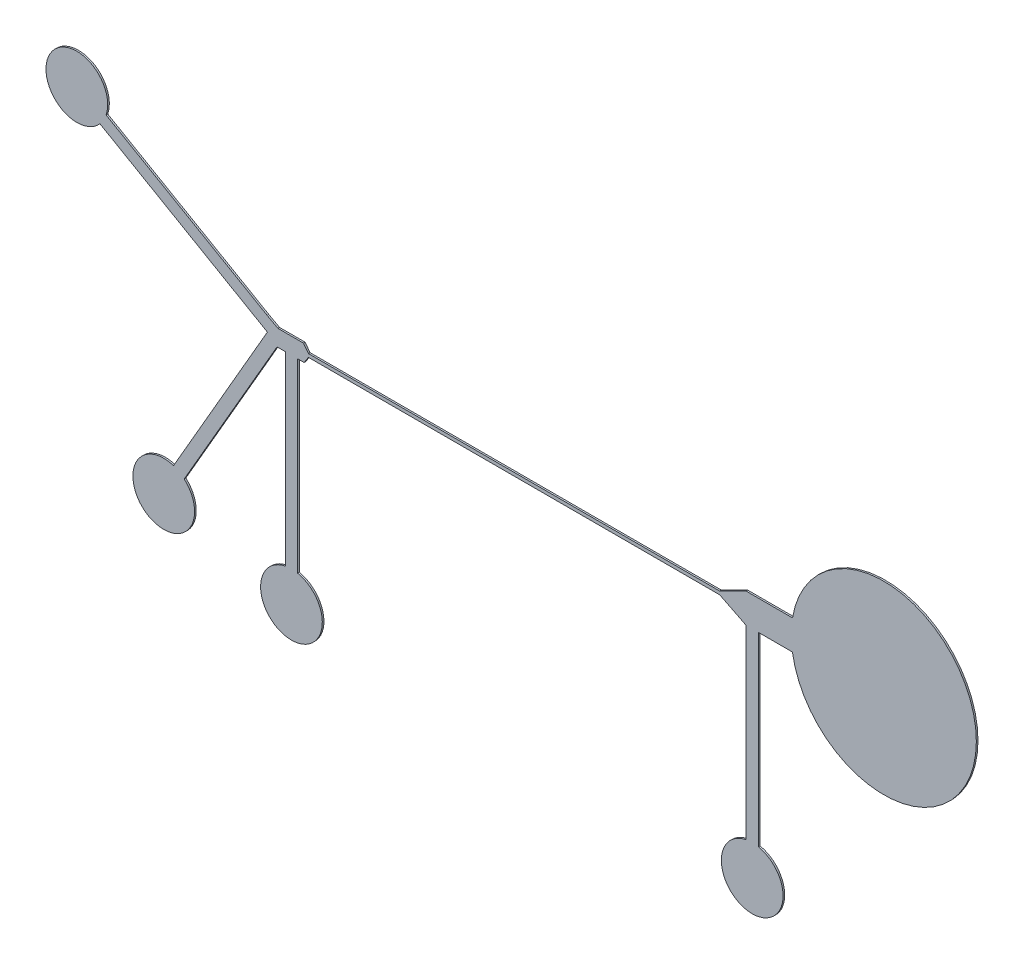
ISO-10303-21;
HEADER;
FILE_DESCRIPTION(('STEP AP214'),'2;1');
FILE_NAME('part.step','',(''),(''),'','','');
FILE_SCHEMA(('AUTOMOTIVE_DESIGN { 1 0 10303 214 1 1 1 1 }'));
ENDSEC;
DATA;
#1=APPLICATION_CONTEXT('core data for automotive mechanical design processes');
#2=APPLICATION_PROTOCOL_DEFINITION('international standard','automotive_design',2000,#1);
#3=PRODUCT_CONTEXT('',#1,'mechanical');
#4=PRODUCT('Part','Part','',(#3));
#5=PRODUCT_RELATED_PRODUCT_CATEGORY('part','',(#4));
#6=PRODUCT_DEFINITION_FORMATION('','',#4);
#7=PRODUCT_DEFINITION_CONTEXT('part definition',#1,'design');
#8=PRODUCT_DEFINITION('design','',#6,#7);
#9=PRODUCT_DEFINITION_SHAPE('','',#8);
#10=(LENGTH_UNIT() NAMED_UNIT(*) SI_UNIT(.MILLI.,.METRE.));
#11=(NAMED_UNIT(*) PLANE_ANGLE_UNIT() SI_UNIT($,.RADIAN.));
#12=(NAMED_UNIT(*) SI_UNIT($,.STERADIAN.) SOLID_ANGLE_UNIT());
#13=UNCERTAINTY_MEASURE_WITH_UNIT(LENGTH_MEASURE(1.E-05),#10,'distance_accuracy_value','');
#14=(GEOMETRIC_REPRESENTATION_CONTEXT(3) GLOBAL_UNCERTAINTY_ASSIGNED_CONTEXT((#13)) GLOBAL_UNIT_ASSIGNED_CONTEXT((#10,
#11,#12)) REPRESENTATION_CONTEXT('',''));
#15=CARTESIAN_POINT('',(0.,0.,0.));
#16=DIRECTION('',(0.,0.,1.));
#17=DIRECTION('',(1.,0.,0.));
#18=AXIS2_PLACEMENT_3D('',#15,#16,#17);
#19=CARTESIAN_POINT('',(-1.71303554255497,-0.242617959881908,0.04));
#20=DIRECTION('',(0.,1.,0.));
#21=DIRECTION('',(0.,0.,1.));
#22=AXIS2_PLACEMENT_3D('',#19,#20,#21);
#23=PLANE('',#22);
#24=DIRECTION('',(1.,0.,0.));
#25=VECTOR('',#24,1.);
#26=CARTESIAN_POINT('',(-1.71303554255497,-0.242617959881908,0.));
#27=LINE('',#26,#25);
#28=CARTESIAN_POINT('',(-1.71303554255497,-0.242617959881908,0.));
#29=VERTEX_POINT('',#28);
#30=CARTESIAN_POINT('',(-1.55303554255497,-0.242617959881908,0.));
#31=VERTEX_POINT('',#30);
#32=EDGE_CURVE('E262',#29,#31,#27,.T.);
#33=ORIENTED_EDGE('',*,*,#32,.T.);
#34=DIRECTION('',(0.,0.,-1.));
#35=VECTOR('',#34,1.);
#36=CARTESIAN_POINT('',(-1.55303554255497,-0.242617959881908,0.04));
#37=LINE('',#36,#35);
#38=CARTESIAN_POINT('',(-1.55303554255497,-0.242617959881908,0.04));
#39=VERTEX_POINT('',#38);
#40=EDGE_CURVE('E52',#39,#31,#37,.T.);
#41=ORIENTED_EDGE('',*,*,#40,.F.);
#42=DIRECTION('',(1.,0.,0.));
#43=VECTOR('',#42,1.);
#44=CARTESIAN_POINT('',(-1.71303554255497,-0.242617959881908,0.04));
#45=LINE('',#44,#43);
#46=CARTESIAN_POINT('',(-1.71303554255497,-0.242617959881908,0.04));
#47=VERTEX_POINT('',#46);
#48=EDGE_CURVE('E160',#47,#39,#45,.T.);
#49=ORIENTED_EDGE('',*,*,#48,.F.);
#50=DIRECTION('',(0.,0.,-1.));
#51=VECTOR('',#50,1.);
#52=CARTESIAN_POINT('',(-1.71303554255497,-0.242617959881908,0.04));
#53=LINE('',#52,#51);
#54=EDGE_CURVE('E11',#47,#29,#53,.T.);
#55=ORIENTED_EDGE('',*,*,#54,.T.);
#56=EDGE_LOOP('',(#33,#41,#49,#55));
#57=FACE_BOUND('',#56,.T.);
#58=ADVANCED_FACE('F43',(#57),#23,.F.);
#59=CARTESIAN_POINT('',(-1.45050282300813,-0.082617959881908,0.04));
#60=DIRECTION('',(-0.841954161364946,0.539549061865787,0.));
#61=DIRECTION('',(-0.539549061865787,-0.841954161364946,0.));
#62=AXIS2_PLACEMENT_3D('',#59,#60,#61);
#63=PLANE('',#62);
#64=DIRECTION('',(0.539549061865787,0.841954161364946,0.));
#65=VECTOR('',#64,1.);
#66=CARTESIAN_POINT('',(-1.45050282300813,-0.082617959881908,0.));
#67=LINE('',#66,#65);
#68=CARTESIAN_POINT('',(-1.45050282300813,-0.082617959881908,0.));
#69=VERTEX_POINT('',#68);
#70=EDGE_CURVE('E265',#31,#69,#67,.T.);
#71=ORIENTED_EDGE('',*,*,#70,.T.);
#72=DIRECTION('',(0.,0.,-1.));
#73=VECTOR('',#72,1.);
#74=CARTESIAN_POINT('',(-1.45050282300813,-0.082617959881908,0.04));
#75=LINE('',#74,#73);
#76=CARTESIAN_POINT('',(-1.45050282300813,-0.082617959881908,0.04));
#77=VERTEX_POINT('',#76);
#78=EDGE_CURVE('E429',#77,#69,#75,.T.);
#79=ORIENTED_EDGE('',*,*,#78,.F.);
#80=DIRECTION('',(0.539549061865787,0.841954161364946,0.));
#81=VECTOR('',#80,1.);
#82=CARTESIAN_POINT('',(-1.45050282300813,-0.082617959881908,0.04));
#83=LINE('',#82,#81);
#84=EDGE_CURVE('E439',#39,#77,#83,.T.);
#85=ORIENTED_EDGE('',*,*,#84,.F.);
#86=ORIENTED_EDGE('',*,*,#40,.T.);
#87=EDGE_LOOP('',(#71,#79,#85,#86));
#88=FACE_BOUND('',#87,.T.);
#89=ADVANCED_FACE('F437',(#88),#63,.F.);
#90=CARTESIAN_POINT('',(-1.45050282300813,-0.082617959881908,0.04));
#91=DIRECTION('',(0.,1.,0.));
#92=DIRECTION('',(0.,0.,1.));
#93=AXIS2_PLACEMENT_3D('',#90,#91,#92);
#94=PLANE('',#93);
#95=DIRECTION('',(1.,0.,0.));
#96=VECTOR('',#95,1.);
#97=CARTESIAN_POINT('',(-1.45050282300813,-0.082617959881908,0.));
#98=LINE('',#97,#96);
#99=CARTESIAN_POINT('',(8.54949717699187,-0.082617959881908,0.));
#100=VERTEX_POINT('',#99);
#101=EDGE_CURVE('E268',#69,#100,#98,.T.);
#102=ORIENTED_EDGE('',*,*,#101,.T.);
#103=DIRECTION('',(0.,0.,-1.));
#104=VECTOR('',#103,1.);
#105=CARTESIAN_POINT('',(8.54949717699187,-0.082617959881908,0.04));
#106=LINE('',#105,#104);
#107=CARTESIAN_POINT('',(8.54949717699187,-0.082617959881908,0.04));
#108=VERTEX_POINT('',#107);
#109=EDGE_CURVE('E425',#108,#100,#106,.T.);
#110=ORIENTED_EDGE('',*,*,#109,.F.);
#111=DIRECTION('',(1.,0.,0.));
#112=VECTOR('',#111,1.);
#113=CARTESIAN_POINT('',(-1.45050282300813,-0.082617959881908,0.04));
#114=LINE('',#113,#112);
#115=EDGE_CURVE('E458',#77,#108,#114,.T.);
#116=ORIENTED_EDGE('',*,*,#115,.F.);
#117=ORIENTED_EDGE('',*,*,#78,.T.);
#118=EDGE_LOOP('',(#102,#110,#116,#117));
#119=FACE_BOUND('',#118,.T.);
#120=ADVANCED_FACE('F448',(#119),#94,.F.);
#121=CARTESIAN_POINT('',(8.54949717699187,-0.082617959881908,0.04));
#122=DIRECTION('',(0.447213595499958,0.894427190999916,0.));
#123=DIRECTION('',(-0.894427190999916,0.447213595499958,0.));
#124=AXIS2_PLACEMENT_3D('',#121,#122,#123);
#125=PLANE('',#124);
#126=DIRECTION('',(0.894427190999916,-0.447213595499958,0.));
#127=VECTOR('',#126,1.);
#128=CARTESIAN_POINT('',(8.54949717699187,-0.082617959881908,0.));
#129=LINE('',#128,#127);
#130=CARTESIAN_POINT('',(9.18949717699187,-0.402617959881908,0.));
#131=VERTEX_POINT('',#130);
#132=EDGE_CURVE('E271',#100,#131,#129,.T.);
#133=ORIENTED_EDGE('',*,*,#132,.T.);
#134=DIRECTION('',(0.,0.,-1.));
#135=VECTOR('',#134,1.);
#136=CARTESIAN_POINT('',(9.18949717699187,-0.402617959881908,0.04));
#137=LINE('',#136,#135);
#138=CARTESIAN_POINT('',(9.18949717699187,-0.402617959881908,0.04));
#139=VERTEX_POINT('',#138);
#140=EDGE_CURVE('E421',#139,#131,#137,.T.);
#141=ORIENTED_EDGE('',*,*,#140,.F.);
#142=DIRECTION('',(0.894427190999916,-0.447213595499958,0.));
#143=VECTOR('',#142,1.);
#144=CARTESIAN_POINT('',(8.54949717699187,-0.082617959881908,0.04));
#145=LINE('',#144,#143);
#146=EDGE_CURVE('E454',#108,#139,#145,.T.);
#147=ORIENTED_EDGE('',*,*,#146,.F.);
#148=ORIENTED_EDGE('',*,*,#109,.T.);
#149=EDGE_LOOP('',(#133,#141,#147,#148));
#150=FACE_BOUND('',#149,.T.);
#151=ADVANCED_FACE('F452',(#150),#125,.F.);
#152=CARTESIAN_POINT('',(9.18949717699187,-4.90261795988191,0.04));
#153=DIRECTION('',(1.,0.,0.));
#154=DIRECTION('',(0.,0.,-1.));
#155=AXIS2_PLACEMENT_3D('',#152,#153,#154);
#156=PLANE('',#155);
#157=DIRECTION('',(0.,-1.,0.));
#158=VECTOR('',#157,1.);
#159=CARTESIAN_POINT('',(9.18949717699187,-4.90261795988191,0.));
#160=LINE('',#159,#158);
#161=CARTESIAN_POINT('',(9.18949717699187,-4.91777103704695,0.));
#162=VERTEX_POINT('',#161);
#163=EDGE_CURVE('E275',#131,#162,#160,.T.);
#164=ORIENTED_EDGE('',*,*,#163,.T.);
#165=DIRECTION('',(0.,0.,-1.));
#166=VECTOR('',#165,1.);
#167=CARTESIAN_POINT('',(9.18949717699187,-4.91777103704695,0.04));
#168=LINE('',#167,#166);
#169=CARTESIAN_POINT('',(9.18949717699187,-4.91777103704695,0.04));
#170=VERTEX_POINT('',#169);
#171=EDGE_CURVE('E417',#170,#162,#168,.T.);
#172=ORIENTED_EDGE('',*,*,#171,.F.);
#173=DIRECTION('',(0.,-1.,0.));
#174=VECTOR('',#173,1.);
#175=CARTESIAN_POINT('',(9.18949717699187,-0.402617959881908,0.04));
#176=LINE('',#175,#174);
#177=EDGE_CURVE('E457',#139,#170,#176,.T.);
#178=ORIENTED_EDGE('',*,*,#177,.F.);
#179=ORIENTED_EDGE('',*,*,#140,.T.);
#180=EDGE_LOOP('',(#164,#172,#178,#179));
#181=FACE_BOUND('',#180,.T.);
#182=ADVANCED_FACE('F550',(#181),#156,.F.);
#183=CARTESIAN_POINT('',(9.33949717699187,-5.65261795988191,0.04));
#184=DIRECTION('',(0.,0.,-1.));
#185=DIRECTION('',(-1.,0.,0.));
#186=AXIS2_PLACEMENT_3D('',#183,#184,#185);
#187=CYLINDRICAL_SURFACE('',#186,0.75);
#188=CARTESIAN_POINT('',(9.33949717699187,-5.65261795988191,0.));
#189=DIRECTION('',(0.,0.,1.));
#190=DIRECTION('',(1.,0.,0.));
#191=AXIS2_PLACEMENT_3D('',#188,#189,#190);
#192=CIRCLE('',#191,0.75);
#193=CARTESIAN_POINT('',(9.48949717699187,-4.91777103704695,0.));
#194=VERTEX_POINT('',#193);
#195=EDGE_CURVE('E278',#162,#194,#192,.T.);
#196=ORIENTED_EDGE('',*,*,#195,.T.);
#197=DIRECTION('',(0.,0.,-1.));
#198=VECTOR('',#197,1.);
#199=CARTESIAN_POINT('',(9.48949717699187,-4.91777103704695,0.04));
#200=LINE('',#199,#198);
#201=CARTESIAN_POINT('',(9.48949717699187,-4.91777103704695,0.04));
#202=VERTEX_POINT('',#201);
#203=EDGE_CURVE('E413',#202,#194,#200,.T.);
#204=ORIENTED_EDGE('',*,*,#203,.F.);
#205=CARTESIAN_POINT('',(9.33949717699187,-5.65261795988191,0.04));
#206=DIRECTION('',(0.,0.,1.));
#207=DIRECTION('',(1.,0.,0.));
#208=AXIS2_PLACEMENT_3D('',#205,#206,#207);
#209=CIRCLE('',#208,0.75);
#210=EDGE_CURVE('E462',#170,#202,#209,.T.);
#211=ORIENTED_EDGE('',*,*,#210,.F.);
#212=ORIENTED_EDGE('',*,*,#171,.T.);
#213=EDGE_LOOP('',(#196,#204,#211,#212));
#214=FACE_BOUND('',#213,.T.);
#215=ADVANCED_FACE('F553',(#214),#187,.T.);
#216=CARTESIAN_POINT('',(9.48949717699187,-0.402617959881908,0.04));
#217=DIRECTION('',(-1.,0.,0.));
#218=DIRECTION('',(0.,0.,1.));
#219=AXIS2_PLACEMENT_3D('',#216,#217,#218);
#220=PLANE('',#219);
#221=DIRECTION('',(0.,1.,0.));
#222=VECTOR('',#221,1.);
#223=CARTESIAN_POINT('',(9.48949717699187,-0.402617959881908,0.));
#224=LINE('',#223,#222);
#225=CARTESIAN_POINT('',(9.48949717699187,-0.402617959881908,0.));
#226=VERTEX_POINT('',#225);
#227=EDGE_CURVE('E282',#194,#226,#224,.T.);
#228=ORIENTED_EDGE('',*,*,#227,.T.);
#229=DIRECTION('',(0.,0.,-1.));
#230=VECTOR('',#229,1.);
#231=CARTESIAN_POINT('',(9.48949717699187,-0.402617959881908,0.04));
#232=LINE('',#231,#230);
#233=CARTESIAN_POINT('',(9.48949717699187,-0.402617959881908,0.04));
#234=VERTEX_POINT('',#233);
#235=EDGE_CURVE('E409',#234,#226,#232,.T.);
#236=ORIENTED_EDGE('',*,*,#235,.F.);
#237=DIRECTION('',(0.,1.,0.));
#238=VECTOR('',#237,1.);
#239=CARTESIAN_POINT('',(9.48949717699187,-4.90261795988191,0.04));
#240=LINE('',#239,#238);
#241=EDGE_CURVE('E469',#202,#234,#240,.T.);
#242=ORIENTED_EDGE('',*,*,#241,.F.);
#243=ORIENTED_EDGE('',*,*,#203,.T.);
#244=EDGE_LOOP('',(#228,#236,#242,#243));
#245=FACE_BOUND('',#244,.T.);
#246=ADVANCED_FACE('F557',(#245),#220,.F.);
#247=CARTESIAN_POINT('',(10.2894971769919,-0.402617959881908,0.04));
#248=DIRECTION('',(0.,1.,0.));
#249=DIRECTION('',(0.,0.,1.));
#250=AXIS2_PLACEMENT_3D('',#247,#248,#249);
#251=PLANE('',#250);
#252=DIRECTION('',(1.,0.,0.));
#253=VECTOR('',#252,1.);
#254=CARTESIAN_POINT('',(10.2894971769919,-0.402617959881908,0.));
#255=LINE('',#254,#253);
#256=CARTESIAN_POINT('',(10.3174084720832,-0.402617959881908,0.));
#257=VERTEX_POINT('',#256);
#258=EDGE_CURVE('E286',#226,#257,#255,.T.);
#259=ORIENTED_EDGE('',*,*,#258,.T.);
#260=DIRECTION('',(0.,0.,-1.));
#261=VECTOR('',#260,1.);
#262=CARTESIAN_POINT('',(10.3174084720832,-0.402617959881908,0.04));
#263=LINE('',#262,#261);
#264=CARTESIAN_POINT('',(10.3174084720832,-0.402617959881908,0.04));
#265=VERTEX_POINT('',#264);
#266=EDGE_CURVE('E405',#265,#257,#263,.T.);
#267=ORIENTED_EDGE('',*,*,#266,.F.);
#268=DIRECTION('',(1.,0.,0.));
#269=VECTOR('',#268,1.);
#270=CARTESIAN_POINT('',(9.48949717699187,-0.402617959881908,0.04));
#271=LINE('',#270,#269);
#272=EDGE_CURVE('E472',#234,#265,#271,.T.);
#273=ORIENTED_EDGE('',*,*,#272,.F.);
#274=ORIENTED_EDGE('',*,*,#235,.T.);
#275=EDGE_LOOP('',(#259,#267,#273,#274));
#276=FACE_BOUND('',#275,.T.);
#277=ADVANCED_FACE('F561',(#276),#251,.F.);
#278=CARTESIAN_POINT('',(12.5394971769919,-0.0493166896926377,0.04));
#279=DIRECTION('',(0.,0.,-1.));
#280=DIRECTION('',(-1.,0.,0.));
#281=AXIS2_PLACEMENT_3D('',#278,#279,#280);
#282=CYLINDRICAL_SURFACE('',#281,2.25);
#283=CARTESIAN_POINT('',(12.5394971769919,-0.0493166896926377,0.));
#284=DIRECTION('',(0.,0.,1.));
#285=DIRECTION('',(1.,0.,0.));
#286=AXIS2_PLACEMENT_3D('',#283,#284,#285);
#287=CIRCLE('',#286,2.25);
#288=CARTESIAN_POINT('',(10.3195800520624,0.317382040118091,0.));
#289=VERTEX_POINT('',#288);
#290=EDGE_CURVE('E289',#257,#289,#287,.T.);
#291=ORIENTED_EDGE('',*,*,#290,.T.);
#292=DIRECTION('',(0.,0.,-1.));
#293=VECTOR('',#292,1.);
#294=CARTESIAN_POINT('',(10.3195800520624,0.317382040118091,0.04));
#295=LINE('',#294,#293);
#296=CARTESIAN_POINT('',(10.3195800520624,0.317382040118091,0.04));
#297=VERTEX_POINT('',#296);
#298=EDGE_CURVE('E401',#297,#289,#295,.T.);
#299=ORIENTED_EDGE('',*,*,#298,.F.);
#300=CARTESIAN_POINT('',(12.5394971769919,-0.0493166896926377,0.04));
#301=DIRECTION('',(0.,0.,1.));
#302=DIRECTION('',(1.,0.,0.));
#303=AXIS2_PLACEMENT_3D('',#300,#301,#302);
#304=CIRCLE('',#303,2.25);
#305=EDGE_CURVE('E475',#265,#297,#304,.T.);
#306=ORIENTED_EDGE('',*,*,#305,.F.);
#307=ORIENTED_EDGE('',*,*,#266,.T.);
#308=EDGE_LOOP('',(#291,#299,#306,#307));
#309=FACE_BOUND('',#308,.T.);
#310=ADVANCED_FACE('F565',(#309),#282,.T.);
#311=CARTESIAN_POINT('',(9.18949717699187,0.317382040118092,0.04));
#312=DIRECTION('',(0.,-1.,0.));
#313=DIRECTION('',(0.,0.,-1.));
#314=AXIS2_PLACEMENT_3D('',#311,#312,#313);
#315=PLANE('',#314);
#316=DIRECTION('',(-1.,0.,0.));
#317=VECTOR('',#316,1.);
#318=CARTESIAN_POINT('',(9.18949717699187,0.317382040118092,0.));
#319=LINE('',#318,#317);
#320=CARTESIAN_POINT('',(9.18949717699187,0.317382040118092,0.));
#321=VERTEX_POINT('',#320);
#322=EDGE_CURVE('E293',#289,#321,#319,.T.);
#323=ORIENTED_EDGE('',*,*,#322,.T.);
#324=DIRECTION('',(0.,0.,-1.));
#325=VECTOR('',#324,1.);
#326=CARTESIAN_POINT('',(9.18949717699187,0.317382040118092,0.04));
#327=LINE('',#326,#325);
#328=CARTESIAN_POINT('',(9.18949717699187,0.317382040118092,0.04));
#329=VERTEX_POINT('',#328);
#330=EDGE_CURVE('E397',#329,#321,#327,.T.);
#331=ORIENTED_EDGE('',*,*,#330,.F.);
#332=DIRECTION('',(-1.,0.,0.));
#333=VECTOR('',#332,1.);
#334=CARTESIAN_POINT('',(10.2894971769919,0.317382040118092,0.04));
#335=LINE('',#334,#333);
#336=EDGE_CURVE('E478',#297,#329,#335,.T.);
#337=ORIENTED_EDGE('',*,*,#336,.F.);
#338=ORIENTED_EDGE('',*,*,#298,.T.);
#339=EDGE_LOOP('',(#323,#331,#337,#338));
#340=FACE_BOUND('',#339,.T.);
#341=ADVANCED_FACE('F569',(#340),#315,.F.);
#342=CARTESIAN_POINT('',(8.54949717699187,-0.0026179598819079,0.04));
#343=DIRECTION('',(0.447213595499958,-0.894427190999916,0.));
#344=DIRECTION('',(0.894427190999916,0.447213595499958,0.));
#345=AXIS2_PLACEMENT_3D('',#342,#343,#344);
#346=PLANE('',#345);
#347=DIRECTION('',(-0.894427190999916,-0.447213595499958,0.));
#348=VECTOR('',#347,1.);
#349=CARTESIAN_POINT('',(8.54949717699187,-0.0026179598819079,0.));
#350=LINE('',#349,#348);
#351=CARTESIAN_POINT('',(8.54949717699187,-0.0026179598819079,0.));
#352=VERTEX_POINT('',#351);
#353=EDGE_CURVE('E296',#321,#352,#350,.T.);
#354=ORIENTED_EDGE('',*,*,#353,.T.);
#355=DIRECTION('',(0.,0.,-1.));
#356=VECTOR('',#355,1.);
#357=CARTESIAN_POINT('',(8.54949717699187,-0.0026179598819079,0.04));
#358=LINE('',#357,#356);
#359=CARTESIAN_POINT('',(8.54949717699187,-0.0026179598819079,0.04));
#360=VERTEX_POINT('',#359);
#361=EDGE_CURVE('E393',#360,#352,#358,.T.);
#362=ORIENTED_EDGE('',*,*,#361,.F.);
#363=DIRECTION('',(-0.894427190999916,-0.447213595499958,0.));
#364=VECTOR('',#363,1.);
#365=CARTESIAN_POINT('',(8.54949717699187,-0.0026179598819079,0.04));
#366=LINE('',#365,#364);
#367=EDGE_CURVE('E481',#329,#360,#366,.T.);
#368=ORIENTED_EDGE('',*,*,#367,.F.);
#369=ORIENTED_EDGE('',*,*,#330,.T.);
#370=EDGE_LOOP('',(#354,#362,#368,#369));
#371=FACE_BOUND('',#370,.T.);
#372=ADVANCED_FACE('F573',(#371),#346,.F.);
#373=CARTESIAN_POINT('',(-1.45050282300813,-0.0026179598819079,0.04));
#374=DIRECTION('',(0.,-1.,0.));
#375=DIRECTION('',(0.,0.,-1.));
#376=AXIS2_PLACEMENT_3D('',#373,#374,#375);
#377=PLANE('',#376);
#378=DIRECTION('',(-1.,0.,0.));
#379=VECTOR('',#378,1.);
#380=CARTESIAN_POINT('',(-1.45050282300813,-0.0026179598819079,0.));
#381=LINE('',#380,#379);
#382=CARTESIAN_POINT('',(-1.45050282300813,-0.0026179598819079,0.));
#383=VERTEX_POINT('',#382);
#384=EDGE_CURVE('E299',#352,#383,#381,.T.);
#385=ORIENTED_EDGE('',*,*,#384,.T.);
#386=DIRECTION('',(0.,0.,-1.));
#387=VECTOR('',#386,1.);
#388=CARTESIAN_POINT('',(-1.45050282300813,-0.0026179598819079,0.04));
#389=LINE('',#388,#387);
#390=CARTESIAN_POINT('',(-1.45050282300813,-0.0026179598819079,0.04));
#391=VERTEX_POINT('',#390);
#392=EDGE_CURVE('E389',#391,#383,#389,.T.);
#393=ORIENTED_EDGE('',*,*,#392,.F.);
#394=DIRECTION('',(-1.,0.,0.));
#395=VECTOR('',#394,1.);
#396=CARTESIAN_POINT('',(-1.45050282300813,-0.0026179598819079,0.04));
#397=LINE('',#396,#395);
#398=EDGE_CURVE('E484',#360,#391,#397,.T.);
#399=ORIENTED_EDGE('',*,*,#398,.F.);
#400=ORIENTED_EDGE('',*,*,#361,.T.);
#401=EDGE_LOOP('',(#385,#393,#399,#400));
#402=FACE_BOUND('',#401,.T.);
#403=ADVANCED_FACE('F577',(#402),#377,.F.);
#404=CARTESIAN_POINT('',(-1.57050282300813,0.157382040118092,0.04));
#405=DIRECTION('',(-0.8,-0.6,0.));
#406=DIRECTION('',(0.6,-0.8,0.));
#407=AXIS2_PLACEMENT_3D('',#404,#405,#406);
#408=PLANE('',#407);
#409=DIRECTION('',(-0.6,0.8,0.));
#410=VECTOR('',#409,1.);
#411=CARTESIAN_POINT('',(-1.57050282300813,0.157382040118092,0.));
#412=LINE('',#411,#410);
#413=CARTESIAN_POINT('',(-1.57050282300813,0.157382040118092,0.));
#414=VERTEX_POINT('',#413);
#415=EDGE_CURVE('E302',#383,#414,#412,.T.);
#416=ORIENTED_EDGE('',*,*,#415,.T.);
#417=DIRECTION('',(0.,0.,-1.));
#418=VECTOR('',#417,1.);
#419=CARTESIAN_POINT('',(-1.57050282300813,0.157382040118092,0.04));
#420=LINE('',#419,#418);
#421=CARTESIAN_POINT('',(-1.57050282300813,0.157382040118092,0.04));
#422=VERTEX_POINT('',#421);
#423=EDGE_CURVE('E385',#422,#414,#420,.T.);
#424=ORIENTED_EDGE('',*,*,#423,.F.);
#425=DIRECTION('',(-0.6,0.8,0.));
#426=VECTOR('',#425,1.);
#427=CARTESIAN_POINT('',(-1.57050282300813,0.157382040118092,0.04));
#428=LINE('',#427,#426);
#429=EDGE_CURVE('E487',#391,#422,#428,.T.);
#430=ORIENTED_EDGE('',*,*,#429,.F.);
#431=ORIENTED_EDGE('',*,*,#392,.T.);
#432=EDGE_LOOP('',(#416,#424,#430,#431));
#433=FACE_BOUND('',#432,.T.);
#434=ADVANCED_FACE('F581',(#433),#408,.F.);
#435=CARTESIAN_POINT('',(-1.8505027448797,0.157382040118092,0.04));
#436=DIRECTION('',(0.,-1.,0.));
#437=DIRECTION('',(1.,0.,0.));
#438=AXIS2_PLACEMENT_3D('',#435,#436,#437);
#439=PLANE('',#438);
#440=DIRECTION('',(-1.,0.,0.));
#441=VECTOR('',#440,1.);
#442=CARTESIAN_POINT('',(-1.8505027448797,0.157382040118092,0.));
#443=LINE('',#442,#441);
#444=CARTESIAN_POINT('',(-2.19126991202879,0.157382040118092,0.));
#445=VERTEX_POINT('',#444);
#446=EDGE_CURVE('E306',#414,#445,#443,.T.);
#447=ORIENTED_EDGE('',*,*,#446,.T.);
#448=DIRECTION('',(0.,0.,-1.));
#449=VECTOR('',#448,1.);
#450=CARTESIAN_POINT('',(-2.19126991202879,0.157382040118092,0.04));
#451=LINE('',#450,#449);
#452=CARTESIAN_POINT('',(-2.19126991202879,0.157382040118092,0.04));
#453=VERTEX_POINT('',#452);
#454=EDGE_CURVE('E381',#453,#445,#451,.T.);
#455=ORIENTED_EDGE('',*,*,#454,.F.);
#456=DIRECTION('',(-1.,0.,0.));
#457=VECTOR('',#456,1.);
#458=CARTESIAN_POINT('',(-1.8505027448797,0.157382040118092,0.04));
#459=LINE('',#458,#457);
#460=EDGE_CURVE('E490',#422,#453,#459,.T.);
#461=ORIENTED_EDGE('',*,*,#460,.F.);
#462=ORIENTED_EDGE('',*,*,#423,.T.);
#463=EDGE_LOOP('',(#447,#455,#461,#462));
#464=FACE_BOUND('',#463,.T.);
#465=ADVANCED_FACE('F585',(#464),#439,.F.);
#466=CARTESIAN_POINT('',(-2.45944570406879,0.303792201631892,0.04));
#467=DIRECTION('',(-0.479186208676208,-0.877713266058182,0.));
#468=DIRECTION('',(0.877713266058183,-0.479186208676208,0.));
#469=AXIS2_PLACEMENT_3D('',#466,#467,#468);
#470=PLANE('',#469);
#471=DIRECTION('',(-0.877713266058182,0.479186208676208,0.));
#472=VECTOR('',#471,1.);
#473=CARTESIAN_POINT('',(-2.45944570406879,0.303792201631892,0.));
#474=LINE('',#473,#472);
#475=CARTESIAN_POINT('',(-2.45944570406879,0.303792201631892,0.));
#476=VERTEX_POINT('',#475);
#477=EDGE_CURVE('E309',#445,#476,#474,.T.);
#478=ORIENTED_EDGE('',*,*,#477,.T.);
#479=DIRECTION('',(0.,0.,-1.));
#480=VECTOR('',#479,1.);
#481=CARTESIAN_POINT('',(-2.45944570406879,0.303792201631892,0.04));
#482=LINE('',#481,#480);
#483=CARTESIAN_POINT('',(-2.45944570406879,0.303792201631892,0.04));
#484=VERTEX_POINT('',#483);
#485=EDGE_CURVE('E377',#484,#476,#482,.T.);
#486=ORIENTED_EDGE('',*,*,#485,.F.);
#487=DIRECTION('',(-0.877713266058182,0.479186208676208,0.));
#488=VECTOR('',#487,1.);
#489=CARTESIAN_POINT('',(-2.45944570406879,0.303792201631892,0.04));
#490=LINE('',#489,#488);
#491=EDGE_CURVE('E493',#453,#484,#490,.T.);
#492=ORIENTED_EDGE('',*,*,#491,.F.);
#493=ORIENTED_EDGE('',*,*,#454,.T.);
#494=EDGE_LOOP('',(#478,#486,#492,#493));
#495=FACE_BOUND('',#494,.T.);
#496=ADVANCED_FACE('F589',(#495),#470,.F.);
#497=CARTESIAN_POINT('',(-6.35656002109876,2.55379220163189,0.04));
#498=DIRECTION('',(-0.500000000000002,-0.866025403784438,0.));
#499=DIRECTION('',(0.866025403784438,-0.500000000000002,0.));
#500=AXIS2_PLACEMENT_3D('',#497,#498,#499);
#501=PLANE('',#500);
#502=DIRECTION('',(-0.866025403784438,0.500000000000002,0.));
#503=VECTOR('',#502,1.);
#504=CARTESIAN_POINT('',(-6.35656002109876,2.55379220163189,0.));
#505=LINE('',#504,#503);
#506=CARTESIAN_POINT('',(-6.36968297086919,2.56136874021441,0.));
#507=VERTEX_POINT('',#506);
#508=EDGE_CURVE('E313',#476,#507,#505,.T.);
#509=ORIENTED_EDGE('',*,*,#508,.T.);
#510=DIRECTION('',(0.,0.,-1.));
#511=VECTOR('',#510,1.);
#512=CARTESIAN_POINT('',(-6.36968297086919,2.56136874021441,0.04));
#513=LINE('',#512,#511);
#514=CARTESIAN_POINT('',(-6.36968297086919,2.56136874021441,0.04));
#515=VERTEX_POINT('',#514);
#516=EDGE_CURVE('E373',#515,#507,#513,.T.);
#517=ORIENTED_EDGE('',*,*,#516,.F.);
#518=DIRECTION('',(-0.866025403784439,0.5,0.));
#519=VECTOR('',#518,1.);
#520=CARTESIAN_POINT('',(-6.35656002109876,2.55379220163189,0.04));
#521=LINE('',#520,#519);
#522=EDGE_CURVE('E496',#484,#515,#521,.T.);
#523=ORIENTED_EDGE('',*,*,#522,.F.);
#524=ORIENTED_EDGE('',*,*,#485,.T.);
#525=EDGE_LOOP('',(#509,#517,#523,#524));
#526=FACE_BOUND('',#525,.T.);
#527=ADVANCED_FACE('F593',(#526),#501,.F.);
#528=CARTESIAN_POINT('',(-7.08107907393708,2.79888839106425,0.04));
#529=DIRECTION('',(0.,0.,-1.));
#530=DIRECTION('',(-1.,0.,0.));
#531=AXIS2_PLACEMENT_3D('',#528,#529,#530);
#532=CYLINDRICAL_SURFACE('',#531,0.75);
#533=CARTESIAN_POINT('',(-7.08107907393708,2.79888839106425,0.));
#534=DIRECTION('',(0.,0.,1.));
#535=DIRECTION('',(1.,0.,0.));
#536=AXIS2_PLACEMENT_3D('',#533,#534,#535);
#537=CIRCLE('',#536,0.75);
#538=CARTESIAN_POINT('',(-6.51967214596148,2.30157333878752,0.));
#539=VERTEX_POINT('',#538);
#540=EDGE_CURVE('E316',#507,#539,#537,.T.);
#541=ORIENTED_EDGE('',*,*,#540,.T.);
#542=DIRECTION('',(0.,0.,-1.));
#543=VECTOR('',#542,1.);
#544=CARTESIAN_POINT('',(-6.51967214596148,2.30157333878752,0.04));
#545=LINE('',#544,#543);
#546=CARTESIAN_POINT('',(-6.51967214596148,2.30157333878752,0.04));
#547=VERTEX_POINT('',#546);
#548=EDGE_CURVE('E369',#547,#539,#545,.T.);
#549=ORIENTED_EDGE('',*,*,#548,.F.);
#550=CARTESIAN_POINT('',(-7.08107907393708,2.79888839106425,0.04));
#551=DIRECTION('',(0.,0.,1.));
#552=DIRECTION('',(1.,0.,0.));
#553=AXIS2_PLACEMENT_3D('',#550,#551,#552);
#554=CIRCLE('',#553,0.75);
#555=EDGE_CURVE('E499',#515,#547,#554,.T.);
#556=ORIENTED_EDGE('',*,*,#555,.F.);
#557=ORIENTED_EDGE('',*,*,#516,.T.);
#558=EDGE_LOOP('',(#541,#549,#556,#557));
#559=FACE_BOUND('',#558,.T.);
#560=ADVANCED_FACE('F597',(#559),#532,.T.);
#561=CARTESIAN_POINT('',(-6.50656002109873,2.29398458049661,0.04));
#562=DIRECTION('',(0.500914062425804,0.865497026028442,0.));
#563=DIRECTION('',(-0.865497026028442,0.500914062425804,0.));
#564=AXIS2_PLACEMENT_3D('',#561,#562,#563);
#565=PLANE('',#564);
#566=DIRECTION('',(0.865497026028442,-0.500914062425804,0.));
#567=VECTOR('',#566,1.);
#568=CARTESIAN_POINT('',(-6.50656002109873,2.29398458049661,0.));
#569=LINE('',#568,#567);
#570=CARTESIAN_POINT('',(-6.50656002109873,2.29398458049661,0.));
#571=VERTEX_POINT('',#570);
#572=EDGE_CURVE('E319',#539,#571,#569,.T.);
#573=ORIENTED_EDGE('',*,*,#572,.T.);
#574=DIRECTION('',(0.,0.,-1.));
#575=VECTOR('',#574,1.);
#576=CARTESIAN_POINT('',(-6.50656002109873,2.29398458049661,0.04));
#577=LINE('',#576,#575);
#578=CARTESIAN_POINT('',(-6.50656002109873,2.29398458049661,0.04));
#579=VERTEX_POINT('',#578);
#580=EDGE_CURVE('E365',#579,#571,#577,.T.);
#581=ORIENTED_EDGE('',*,*,#580,.F.);
#582=DIRECTION('',(0.865497026028442,-0.500914062425804,0.));
#583=VECTOR('',#582,1.);
#584=CARTESIAN_POINT('',(-6.50656002109873,2.29398458049661,0.04));
#585=LINE('',#584,#583);
#586=EDGE_CURVE('E502',#547,#579,#585,.T.);
#587=ORIENTED_EDGE('',*,*,#586,.F.);
#588=ORIENTED_EDGE('',*,*,#548,.T.);
#589=EDGE_LOOP('',(#573,#581,#587,#588));
#590=FACE_BOUND('',#589,.T.);
#591=ADVANCED_FACE('F601',(#590),#565,.F.);
#592=CARTESIAN_POINT('',(-2.44785396669216,-0.049310452576595,0.04));
#593=DIRECTION('',(0.5,0.866025403784439,0.));
#594=DIRECTION('',(-0.866025403784439,0.5,0.));
#595=AXIS2_PLACEMENT_3D('',#592,#593,#594);
#596=PLANE('',#595);
#597=DIRECTION('',(0.866025403784439,-0.5,0.));
#598=VECTOR('',#597,1.);
#599=CARTESIAN_POINT('',(-2.44785396669216,-0.049310452576595,0.));
#600=LINE('',#599,#598);
#601=CARTESIAN_POINT('',(-2.44785396669216,-0.049310452576595,0.));
#602=VERTEX_POINT('',#601);
#603=EDGE_CURVE('E322',#571,#602,#600,.T.);
#604=ORIENTED_EDGE('',*,*,#603,.T.);
#605=DIRECTION('',(0.,0.,-1.));
#606=VECTOR('',#605,1.);
#607=CARTESIAN_POINT('',(-2.44785396669216,-0.049310452576595,0.04));
#608=LINE('',#607,#606);
#609=CARTESIAN_POINT('',(-2.44785396669216,-0.049310452576595,0.04));
#610=VERTEX_POINT('',#609);
#611=EDGE_CURVE('E361',#610,#602,#608,.T.);
#612=ORIENTED_EDGE('',*,*,#611,.F.);
#613=DIRECTION('',(0.866025403784439,-0.5,0.));
#614=VECTOR('',#613,1.);
#615=CARTESIAN_POINT('',(-2.44785396669216,-0.049310452576595,0.04));
#616=LINE('',#615,#614);
#617=EDGE_CURVE('E505',#579,#610,#616,.T.);
#618=ORIENTED_EDGE('',*,*,#617,.F.);
#619=ORIENTED_EDGE('',*,*,#580,.T.);
#620=EDGE_LOOP('',(#604,#612,#618,#619));
#621=FACE_BOUND('',#620,.T.);
#622=ADVANCED_FACE('F605',(#621),#596,.F.);
#623=CARTESIAN_POINT('',(-4.72285396669218,-3.98972603979584,0.04));
#624=DIRECTION('',(0.866025403784448,-0.499999999999984,0.));
#625=DIRECTION('',(0.499999999999984,0.866025403784448,0.));
#626=AXIS2_PLACEMENT_3D('',#623,#624,#625);
#627=PLANE('',#626);
#628=DIRECTION('',(-0.499999999999984,-0.866025403784448,0.));
#629=VECTOR('',#628,1.);
#630=CARTESIAN_POINT('',(-4.72285396669218,-3.98972603979584,0.));
#631=LINE('',#630,#629);
#632=CARTESIAN_POINT('',(-4.73043177847577,-4.00285119481521,0.));
#633=VERTEX_POINT('',#632);
#634=EDGE_CURVE('E326',#602,#633,#631,.T.);
#635=ORIENTED_EDGE('',*,*,#634,.T.);
#636=DIRECTION('',(0.,0.,-1.));
#637=VECTOR('',#636,1.);
#638=CARTESIAN_POINT('',(-4.73043177847577,-4.00285119481521,0.04));
#639=LINE('',#638,#637);
#640=CARTESIAN_POINT('',(-4.73043177847577,-4.00285119481521,0.04));
#641=VERTEX_POINT('',#640);
#642=EDGE_CURVE('E357',#641,#633,#639,.T.);
#643=ORIENTED_EDGE('',*,*,#642,.F.);
#644=DIRECTION('',(-0.5,-0.866025403784439,0.));
#645=VECTOR('',#644,1.);
#646=CARTESIAN_POINT('',(-4.72285396669218,-3.98972603979584,0.04));
#647=LINE('',#646,#645);
#648=EDGE_CURVE('E508',#610,#641,#647,.T.);
#649=ORIENTED_EDGE('',*,*,#648,.F.);
#650=ORIENTED_EDGE('',*,*,#611,.T.);
#651=EDGE_LOOP('',(#635,#643,#649,#650));
#652=FACE_BOUND('',#651,.T.);
#653=ADVANCED_FACE('F609',(#652),#627,.F.);
#654=CARTESIAN_POINT('',(-4.96793935312313,-4.71425132974993,0.04));
#655=DIRECTION('',(0.,0.,-1.));
#656=DIRECTION('',(-1.,0.,0.));
#657=AXIS2_PLACEMENT_3D('',#654,#655,#656);
#658=CYLINDRICAL_SURFACE('',#657,0.75);
#659=CARTESIAN_POINT('',(-4.96793935312313,-4.71425132974993,0.));
#660=DIRECTION('',(0.,0.,1.));
#661=DIRECTION('',(1.,0.,0.));
#662=AXIS2_PLACEMENT_3D('',#659,#660,#661);
#663=CIRCLE('',#662,0.75);
#664=CARTESIAN_POINT('',(-4.47060335741425,-4.15286295493953,0.));
#665=VERTEX_POINT('',#664);
#666=EDGE_CURVE('E329',#633,#665,#663,.T.);
#667=ORIENTED_EDGE('',*,*,#666,.T.);
#668=DIRECTION('',(0.,0.,-1.));
#669=VECTOR('',#668,1.);
#670=CARTESIAN_POINT('',(-4.47060335741425,-4.15286295493953,0.04));
#671=LINE('',#670,#669);
#672=CARTESIAN_POINT('',(-4.47060335741425,-4.15286295493953,0.04));
#673=VERTEX_POINT('',#672);
#674=EDGE_CURVE('E353',#673,#665,#671,.T.);
#675=ORIENTED_EDGE('',*,*,#674,.F.);
#676=CARTESIAN_POINT('',(-4.96793935312313,-4.71425132974993,0.04));
#677=DIRECTION('',(0.,0.,1.));
#678=DIRECTION('',(1.,0.,0.));
#679=AXIS2_PLACEMENT_3D('',#676,#677,#678);
#680=CIRCLE('',#679,0.75);
#681=EDGE_CURVE('E511',#641,#673,#680,.T.);
#682=ORIENTED_EDGE('',*,*,#681,.F.);
#683=ORIENTED_EDGE('',*,*,#642,.T.);
#684=EDGE_LOOP('',(#667,#675,#682,#683));
#685=FACE_BOUND('',#684,.T.);
#686=ADVANCED_FACE('F613',(#685),#658,.T.);
#687=CARTESIAN_POINT('',(-2.21303554255497,-0.242617959881908,0.04));
#688=DIRECTION('',(-0.866026789806903,0.499997599330986,0.));
#689=DIRECTION('',(-0.499997599330987,-0.866026789806904,0.));
#690=AXIS2_PLACEMENT_3D('',#687,#688,#689);
#691=PLANE('',#690);
#692=DIRECTION('',(0.499997599330986,0.866026789806903,0.));
#693=VECTOR('',#692,1.);
#694=CARTESIAN_POINT('',(-2.21303554255497,-0.242617959881908,0.));
#695=LINE('',#694,#693);
#696=CARTESIAN_POINT('',(-4.46302473955306,-4.13973851402795,0.));
#697=VERTEX_POINT('',#696);
#698=CARTESIAN_POINT('',(-2.21303554255497,-0.242617959881908,0.));
#699=VERTEX_POINT('',#698);
#700=EDGE_CURVE('E335',#697,#699,#695,.T.);
#701=ORIENTED_EDGE('',*,*,#700,.T.);
#702=DIRECTION('',(0.,0.,-1.));
#703=VECTOR('',#702,1.);
#704=CARTESIAN_POINT('',(-2.21303554255497,-0.242617959881908,0.04));
#705=LINE('',#704,#703);
#706=CARTESIAN_POINT('',(-2.21303554255497,-0.242617959881908,0.04));
#707=VERTEX_POINT('',#706);
#708=EDGE_CURVE('E249',#707,#699,#705,.T.);
#709=ORIENTED_EDGE('',*,*,#708,.F.);
#710=DIRECTION('',(0.499997599330986,0.866026789806903,0.));
#711=VECTOR('',#710,1.);
#712=CARTESIAN_POINT('',(-2.21303554255497,-0.242617959881908,0.04));
#713=LINE('',#712,#711);
#714=CARTESIAN_POINT('',(-4.46302473955306,-4.13973851402795,0.04));
#715=VERTEX_POINT('',#714);
#716=EDGE_CURVE('E237',#715,#707,#713,.T.);
#717=ORIENTED_EDGE('',*,*,#716,.F.);
#718=DIRECTION('',(0.50006029250884,0.865990591089749,0.));
#719=VECTOR('',#718,1.);
#720=CARTESIAN_POINT('',(-4.46302473955306,-4.13973851402795,0.04));
#721=LINE('',#720,#719);
#722=EDGE_CURVE('E514',#673,#715,#721,.T.);
#723=ORIENTED_EDGE('',*,*,#722,.F.);
#724=ORIENTED_EDGE('',*,*,#674,.T.);
#725=DIRECTION('',(0.50006029250884,0.865990591089749,0.));
#726=VECTOR('',#725,1.);
#727=CARTESIAN_POINT('',(-4.46302473955306,-4.13973851402795,0.));
#728=LINE('',#727,#726);
#729=EDGE_CURVE('E332',#665,#697,#728,.T.);
#730=ORIENTED_EDGE('',*,*,#729,.T.);
#731=EDGE_LOOP('',(#701,#709,#717,#723,#724,#730));
#732=FACE_BOUND('',#731,.T.);
#733=ADVANCED_FACE('F521',(#732),#691,.F.);
#734=CARTESIAN_POINT('',(-2.21303554255497,-0.242617959881908,0.04));
#735=DIRECTION('',(0.,1.,0.));
#736=DIRECTION('',(0.,0.,1.));
#737=AXIS2_PLACEMENT_3D('',#734,#735,#736);
#738=PLANE('',#737);
#739=DIRECTION('',(1.,0.,0.));
#740=VECTOR('',#739,1.);
#741=CARTESIAN_POINT('',(-2.21303554255497,-0.242617959881908,0.));
#742=LINE('',#741,#740);
#743=CARTESIAN_POINT('',(-2.01303554255497,-0.242617959881908,0.));
#744=VERTEX_POINT('',#743);
#745=EDGE_CURVE('E247',#699,#744,#742,.T.);
#746=ORIENTED_EDGE('',*,*,#745,.T.);
#747=DIRECTION('',(0.,0.,-1.));
#748=VECTOR('',#747,1.);
#749=CARTESIAN_POINT('',(-2.01303554255497,-0.242617959881908,0.04));
#750=LINE('',#749,#748);
#751=CARTESIAN_POINT('',(-2.01303554255497,-0.242617959881908,0.04));
#752=VERTEX_POINT('',#751);
#753=EDGE_CURVE('E244',#752,#744,#750,.T.);
#754=ORIENTED_EDGE('',*,*,#753,.F.);
#755=DIRECTION('',(1.,0.,0.));
#756=VECTOR('',#755,1.);
#757=CARTESIAN_POINT('',(-2.21303554255497,-0.242617959881908,0.04));
#758=LINE('',#757,#756);
#759=EDGE_CURVE('E231',#707,#752,#758,.T.);
#760=ORIENTED_EDGE('',*,*,#759,.F.);
#761=ORIENTED_EDGE('',*,*,#708,.T.);
#762=EDGE_LOOP('',(#746,#754,#760,#761));
#763=FACE_BOUND('',#762,.T.);
#764=ADVANCED_FACE('F245',(#763),#738,.F.);
#765=CARTESIAN_POINT('',(-2.01303554255497,-4.74261795988191,0.04));
#766=DIRECTION('',(1.,0.,0.));
#767=DIRECTION('',(0.,0.,-1.));
#768=AXIS2_PLACEMENT_3D('',#765,#766,#767);
#769=PLANE('',#768);
#770=DIRECTION('',(0.,-1.,0.));
#771=VECTOR('',#770,1.);
#772=CARTESIAN_POINT('',(-2.01303554255497,-4.74261795988191,0.));
#773=LINE('',#772,#771);
#774=CARTESIAN_POINT('',(-2.01303554255497,-4.75777103704695,0.));
#775=VERTEX_POINT('',#774);
#776=EDGE_CURVE('E146',#744,#775,#773,.T.);
#777=ORIENTED_EDGE('',*,*,#776,.T.);
#778=DIRECTION('',(0.,0.,-1.));
#779=VECTOR('',#778,1.);
#780=CARTESIAN_POINT('',(-2.01303554255497,-4.75777103704695,0.04));
#781=LINE('',#780,#779);
#782=CARTESIAN_POINT('',(-2.01303554255497,-4.75777103704695,0.04));
#783=VERTEX_POINT('',#782);
#784=EDGE_CURVE('E250',#783,#775,#781,.T.);
#785=ORIENTED_EDGE('',*,*,#784,.F.);
#786=DIRECTION('',(0.,-1.,0.));
#787=VECTOR('',#786,1.);
#788=CARTESIAN_POINT('',(-2.01303554255497,-0.242617959881908,0.04));
#789=LINE('',#788,#787);
#790=EDGE_CURVE('E235',#752,#783,#789,.T.);
#791=ORIENTED_EDGE('',*,*,#790,.F.);
#792=ORIENTED_EDGE('',*,*,#753,.T.);
#793=EDGE_LOOP('',(#777,#785,#791,#792));
#794=FACE_BOUND('',#793,.T.);
#795=ADVANCED_FACE('F252',(#794),#769,.F.);
#796=CARTESIAN_POINT('',(-1.86303554255497,-5.49261795988191,0.04));
#797=DIRECTION('',(0.,0.,-1.));
#798=DIRECTION('',(-1.,0.,0.));
#799=AXIS2_PLACEMENT_3D('',#796,#797,#798);
#800=CYLINDRICAL_SURFACE('',#799,0.75);
#801=CARTESIAN_POINT('',(-1.86303554255497,-5.49261795988191,0.));
#802=DIRECTION('',(0.,0.,1.));
#803=DIRECTION('',(1.,0.,0.));
#804=AXIS2_PLACEMENT_3D('',#801,#802,#803);
#805=CIRCLE('',#804,0.75);
#806=CARTESIAN_POINT('',(-1.71303554255497,-4.75777103704695,0.));
#807=VERTEX_POINT('',#806);
#808=EDGE_CURVE('E153',#775,#807,#805,.T.);
#809=ORIENTED_EDGE('',*,*,#808,.T.);
#810=DIRECTION('',(0.,0.,-1.));
#811=VECTOR('',#810,1.);
#812=CARTESIAN_POINT('',(-1.71303554255497,-4.75777103704695,0.04));
#813=LINE('',#812,#811);
#814=CARTESIAN_POINT('',(-1.71303554255497,-4.75777103704695,0.04));
#815=VERTEX_POINT('',#814);
#816=EDGE_CURVE('E258',#815,#807,#813,.T.);
#817=ORIENTED_EDGE('',*,*,#816,.F.);
#818=CARTESIAN_POINT('',(-1.86303554255497,-5.49261795988191,0.04));
#819=DIRECTION('',(0.,0.,1.));
#820=DIRECTION('',(1.,0.,0.));
#821=AXIS2_PLACEMENT_3D('',#818,#819,#820);
#822=CIRCLE('',#821,0.75);
#823=EDGE_CURVE('E255',#783,#815,#822,.T.);
#824=ORIENTED_EDGE('',*,*,#823,.F.);
#825=ORIENTED_EDGE('',*,*,#784,.T.);
#826=EDGE_LOOP('',(#809,#817,#824,#825));
#827=FACE_BOUND('',#826,.T.);
#828=ADVANCED_FACE('F525',(#827),#800,.T.);
#829=CARTESIAN_POINT('',(-1.71303554255497,-4.74261795988191,0.04));
#830=DIRECTION('',(-1.,0.,0.));
#831=DIRECTION('',(0.,-1.,0.));
#832=AXIS2_PLACEMENT_3D('',#829,#830,#831);
#833=PLANE('',#832);
#834=DIRECTION('',(0.,1.,0.));
#835=VECTOR('',#834,1.);
#836=CARTESIAN_POINT('',(-1.71303554255497,-4.74261795988191,0.));
#837=LINE('',#836,#835);
#838=EDGE_CURVE('E344',#807,#29,#837,.T.);
#839=ORIENTED_EDGE('',*,*,#838,.T.);
#840=ORIENTED_EDGE('',*,*,#54,.F.);
#841=DIRECTION('',(0.,1.,0.));
#842=VECTOR('',#841,1.);
#843=CARTESIAN_POINT('',(-1.71303554255497,-0.242617959881908,0.04));
#844=LINE('',#843,#842);
#845=EDGE_CURVE('E60',#815,#47,#844,.T.);
#846=ORIENTED_EDGE('',*,*,#845,.F.);
#847=ORIENTED_EDGE('',*,*,#816,.T.);
#848=EDGE_LOOP('',(#839,#840,#846,#847));
#849=FACE_BOUND('',#848,.T.);
#850=ADVANCED_FACE('F524',(#849),#833,.F.);
#851=CARTESIAN_POINT('',(-1.86303554255497,-5.49261795988191,0.04));
#852=DIRECTION('',(0.,0.,1.));
#853=DIRECTION('',(1.,0.,0.));
#854=AXIS2_PLACEMENT_3D('',#851,#852,#853);
#855=PLANE('',#854);
#856=ORIENTED_EDGE('',*,*,#845,.T.);
#857=ORIENTED_EDGE('',*,*,#48,.T.);
#858=ORIENTED_EDGE('',*,*,#84,.T.);
#859=ORIENTED_EDGE('',*,*,#115,.T.);
#860=ORIENTED_EDGE('',*,*,#146,.T.);
#861=ORIENTED_EDGE('',*,*,#177,.T.);
#862=ORIENTED_EDGE('',*,*,#210,.T.);
#863=ORIENTED_EDGE('',*,*,#241,.T.);
#864=ORIENTED_EDGE('',*,*,#272,.T.);
#865=ORIENTED_EDGE('',*,*,#305,.T.);
#866=ORIENTED_EDGE('',*,*,#336,.T.);
#867=ORIENTED_EDGE('',*,*,#367,.T.);
#868=ORIENTED_EDGE('',*,*,#398,.T.);
#869=ORIENTED_EDGE('',*,*,#429,.T.);
#870=ORIENTED_EDGE('',*,*,#460,.T.);
#871=ORIENTED_EDGE('',*,*,#491,.T.);
#872=ORIENTED_EDGE('',*,*,#522,.T.);
#873=ORIENTED_EDGE('',*,*,#555,.T.);
#874=ORIENTED_EDGE('',*,*,#586,.T.);
#875=ORIENTED_EDGE('',*,*,#617,.T.);
#876=ORIENTED_EDGE('',*,*,#648,.T.);
#877=ORIENTED_EDGE('',*,*,#681,.T.);
#878=ORIENTED_EDGE('',*,*,#722,.T.);
#879=ORIENTED_EDGE('',*,*,#716,.T.);
#880=ORIENTED_EDGE('',*,*,#759,.T.);
#881=ORIENTED_EDGE('',*,*,#790,.T.);
#882=ORIENTED_EDGE('',*,*,#823,.T.);
#883=EDGE_LOOP('',(#856,#857,#858,#859,#860,#861,#862,#863,#864,#865,#866,#867,#868,#869,#870,
#871,#872,#873,#874,#875,#876,#877,#878,#879,#880,#881,#882));
#884=FACE_BOUND('',#883,.T.);
#885=ADVANCED_FACE('F233',(#884),#855,.T.);
#886=CARTESIAN_POINT('',(-1.86303554255497,-5.49261795988191,0.));
#887=DIRECTION('',(0.,0.,1.));
#888=DIRECTION('',(1.,0.,0.));
#889=AXIS2_PLACEMENT_3D('',#886,#887,#888);
#890=PLANE('',#889);
#891=ORIENTED_EDGE('',*,*,#32,.F.);
#892=ORIENTED_EDGE('',*,*,#838,.F.);
#893=ORIENTED_EDGE('',*,*,#808,.F.);
#894=ORIENTED_EDGE('',*,*,#776,.F.);
#895=ORIENTED_EDGE('',*,*,#745,.F.);
#896=ORIENTED_EDGE('',*,*,#700,.F.);
#897=ORIENTED_EDGE('',*,*,#729,.F.);
#898=ORIENTED_EDGE('',*,*,#666,.F.);
#899=ORIENTED_EDGE('',*,*,#634,.F.);
#900=ORIENTED_EDGE('',*,*,#603,.F.);
#901=ORIENTED_EDGE('',*,*,#572,.F.);
#902=ORIENTED_EDGE('',*,*,#540,.F.);
#903=ORIENTED_EDGE('',*,*,#508,.F.);
#904=ORIENTED_EDGE('',*,*,#477,.F.);
#905=ORIENTED_EDGE('',*,*,#446,.F.);
#906=ORIENTED_EDGE('',*,*,#415,.F.);
#907=ORIENTED_EDGE('',*,*,#384,.F.);
#908=ORIENTED_EDGE('',*,*,#353,.F.);
#909=ORIENTED_EDGE('',*,*,#322,.F.);
#910=ORIENTED_EDGE('',*,*,#290,.F.);
#911=ORIENTED_EDGE('',*,*,#258,.F.);
#912=ORIENTED_EDGE('',*,*,#227,.F.);
#913=ORIENTED_EDGE('',*,*,#195,.F.);
#914=ORIENTED_EDGE('',*,*,#163,.F.);
#915=ORIENTED_EDGE('',*,*,#132,.F.);
#916=ORIENTED_EDGE('',*,*,#101,.F.);
#917=ORIENTED_EDGE('',*,*,#70,.F.);
#918=EDGE_LOOP('',(#891,#892,#893,#894,#895,#896,#897,#898,#899,#900,#901,#902,#903,#904,#905,
#906,#907,#908,#909,#910,#911,#912,#913,#914,#915,#916,#917));
#919=FACE_BOUND('',#918,.T.);
#920=ADVANCED_FACE('F443',(#919),#890,.F.);
#921=CLOSED_SHELL('',(#58,#89,#120,#151,#182,#215,#246,#277,#310,#341,#372,#403,#434,#465,#496,
#527,#560,#591,#622,#653,#686,#733,#764,#795,#828,#850,#885,#920));
#922=MANIFOLD_SOLID_BREP('B2',#921);
#923=ADVANCED_BREP_SHAPE_REPRESENTATION('',(#18,#922),#14);
#924=SHAPE_DEFINITION_REPRESENTATION(#9,#923);
ENDSEC;
END-ISO-10303-21;
